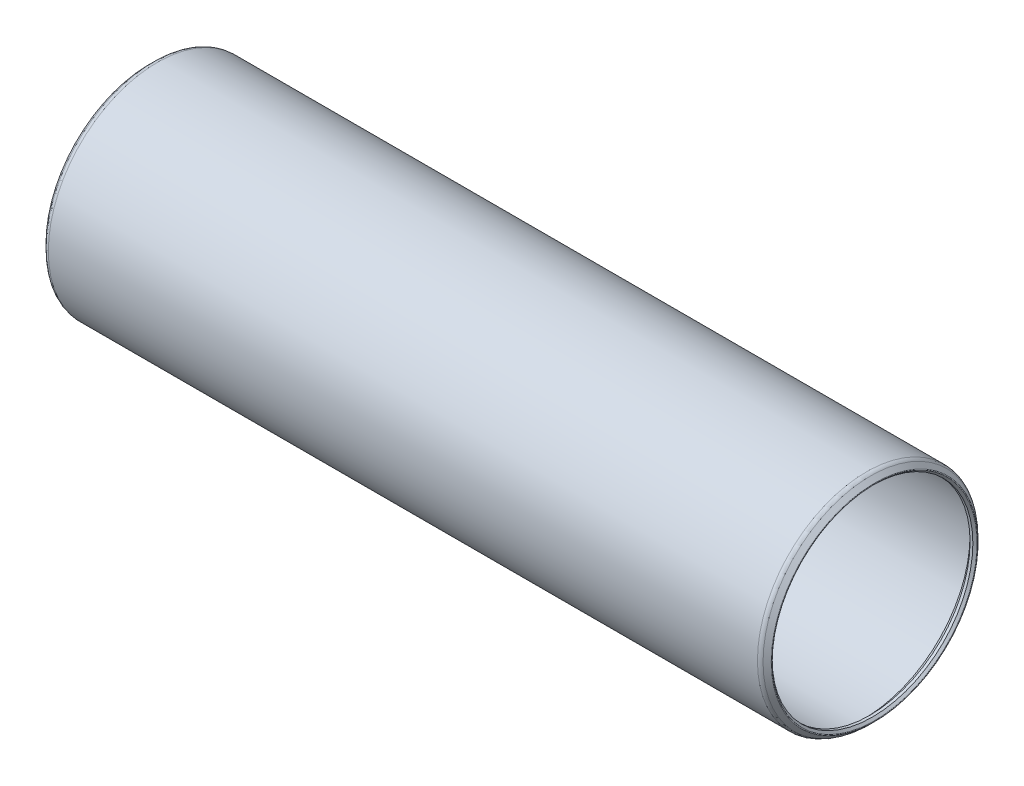
ISO-10303-21;
HEADER;
FILE_DESCRIPTION(('STEP AP214'),'2;1');
FILE_NAME('part.step','',(''),(''),'','','');
FILE_SCHEMA(('AUTOMOTIVE_DESIGN { 1 0 10303 214 1 1 1 1 }'));
ENDSEC;
DATA;
#1=APPLICATION_CONTEXT('core data for automotive mechanical design processes');
#2=APPLICATION_PROTOCOL_DEFINITION('international standard','automotive_design',2000,#1);
#3=PRODUCT_CONTEXT('',#1,'mechanical');
#4=PRODUCT('Part','Part','',(#3));
#5=PRODUCT_RELATED_PRODUCT_CATEGORY('part','',(#4));
#6=PRODUCT_DEFINITION_FORMATION('','',#4);
#7=PRODUCT_DEFINITION_CONTEXT('part definition',#1,'design');
#8=PRODUCT_DEFINITION('design','',#6,#7);
#9=PRODUCT_DEFINITION_SHAPE('','',#8);
#10=(LENGTH_UNIT() NAMED_UNIT(*) SI_UNIT(.MILLI.,.METRE.));
#11=(NAMED_UNIT(*) PLANE_ANGLE_UNIT() SI_UNIT($,.RADIAN.));
#12=(NAMED_UNIT(*) SI_UNIT($,.STERADIAN.) SOLID_ANGLE_UNIT());
#13=UNCERTAINTY_MEASURE_WITH_UNIT(LENGTH_MEASURE(1.E-05),#10,'distance_accuracy_value','');
#14=(GEOMETRIC_REPRESENTATION_CONTEXT(3) GLOBAL_UNCERTAINTY_ASSIGNED_CONTEXT((#13)) GLOBAL_UNIT_ASSIGNED_CONTEXT((#10,
#11,#12)) REPRESENTATION_CONTEXT('',''));
#15=CARTESIAN_POINT('',(0.,0.,0.));
#16=DIRECTION('',(0.,0.,1.));
#17=DIRECTION('',(1.,0.,0.));
#18=AXIS2_PLACEMENT_3D('',#15,#16,#17);
#19=CARTESIAN_POINT('',(-0.792815367264612,0.,0.));
#20=DIRECTION('',(-1.,0.,0.));
#21=DIRECTION('',(0.,0.,1.));
#22=AXIS2_PLACEMENT_3D('',#19,#20,#21);
#23=TOROIDAL_SURFACE('',#22,18.6444704896855,0.126999999999538);
#24=CARTESIAN_POINT('',(-0.882617928474827,0.,0.));
#25=DIRECTION('',(-1.,0.,0.));
#26=DIRECTION('',(0.,0.,1.));
#27=AXIS2_PLACEMENT_3D('',#24,#25,#26);
#28=CIRCLE('',#27,18.554667928475);
#29=CARTESIAN_POINT('',(-0.882617928474827,0.,18.554667928475));
#30=VERTEX_POINT('',#29);
#31=EDGE_CURVE('E10',#30,#30,#28,.T.);
#32=ORIENTED_EDGE('',*,*,#31,.F.);
#33=EDGE_LOOP('',(#32));
#34=FACE_BOUND('',#33,.T.);
#35=CARTESIAN_POINT('',(-0.882617928474827,0.,0.));
#36=DIRECTION('',(-1.,0.,0.));
#37=DIRECTION('',(0.,0.,1.));
#38=AXIS2_PLACEMENT_3D('',#35,#36,#37);
#39=CIRCLE('',#38,18.734273050896);
#40=CARTESIAN_POINT('',(-0.882617928474827,0.,18.734273050896));
#41=VERTEX_POINT('',#40);
#42=EDGE_CURVE('E82',#41,#41,#39,.T.);
#43=ORIENTED_EDGE('',*,*,#42,.T.);
#44=EDGE_LOOP('',(#43));
#45=FACE_BOUND('',#44,.T.);
#46=ADVANCED_FACE('F36',(#34,#45),#23,.T.);
#47=CARTESIAN_POINT('',(-0.882617928474827,0.,0.));
#48=DIRECTION('',(-1.,0.,0.));
#49=DIRECTION('',(0.,0.,1.));
#50=AXIS2_PLACEMENT_3D('',#47,#48,#49);
#51=CONICAL_SURFACE('',#50,18.554667928475,0.785398163397684);
#52=CARTESIAN_POINT('',(-0.508000000000008,0.,0.));
#53=DIRECTION('',(-1.,0.,0.));
#54=DIRECTION('',(0.,0.,1.));
#55=AXIS2_PLACEMENT_3D('',#52,#53,#54);
#56=CIRCLE('',#55,18.18005);
#57=CARTESIAN_POINT('',(-0.508000000000008,0.,18.18005));
#58=VERTEX_POINT('',#57);
#59=EDGE_CURVE('E42',#58,#58,#56,.T.);
#60=ORIENTED_EDGE('',*,*,#59,.F.);
#61=EDGE_LOOP('',(#60));
#62=FACE_BOUND('',#61,.T.);
#63=ORIENTED_EDGE('',*,*,#31,.T.);
#64=EDGE_LOOP('',(#63));
#65=FACE_BOUND('',#64,.T.);
#66=ADVANCED_FACE('F155',(#62,#65),#51,.F.);
#67=CARTESIAN_POINT('',(129.6035,0.,0.));
#68=DIRECTION('',(-1.,0.,0.));
#69=DIRECTION('',(0.,0.,1.));
#70=AXIS2_PLACEMENT_3D('',#67,#68,#69);
#71=CYLINDRICAL_SURFACE('',#70,18.18005);
#72=CARTESIAN_POINT('',(0.,0.,0.));
#73=DIRECTION('',(-1.,0.,0.));
#74=DIRECTION('',(0.,0.,1.));
#75=AXIS2_PLACEMENT_3D('',#72,#73,#74);
#76=CIRCLE('',#75,18.18005);
#77=CARTESIAN_POINT('',(0.,0.,18.18005));
#78=VERTEX_POINT('',#77);
#79=EDGE_CURVE('E46',#78,#78,#76,.T.);
#80=ORIENTED_EDGE('',*,*,#79,.F.);
#81=EDGE_LOOP('',(#80));
#82=FACE_BOUND('',#81,.T.);
#83=ORIENTED_EDGE('',*,*,#59,.T.);
#84=EDGE_LOOP('',(#83));
#85=FACE_BOUND('',#84,.T.);
#86=ADVANCED_FACE('F150',(#82,#85),#71,.F.);
#87=CARTESIAN_POINT('',(0.,0.,0.));
#88=DIRECTION('',(1.,0.,0.));
#89=DIRECTION('',(0.,0.,-1.));
#90=AXIS2_PLACEMENT_3D('',#87,#88,#89);
#91=CONICAL_SURFACE('',#90,18.18005,0.785398163397452);
#92=CARTESIAN_POINT('',(1.01599999999999,0.,0.));
#93=DIRECTION('',(-1.,0.,0.));
#94=DIRECTION('',(0.,0.,1.));
#95=AXIS2_PLACEMENT_3D('',#92,#93,#94);
#96=CIRCLE('',#95,19.19605);
#97=CARTESIAN_POINT('',(1.01599999999999,0.,19.19605));
#98=VERTEX_POINT('',#97);
#99=EDGE_CURVE('E50',#98,#98,#96,.T.);
#100=ORIENTED_EDGE('',*,*,#99,.F.);
#101=EDGE_LOOP('',(#100));
#102=FACE_BOUND('',#101,.T.);
#103=ORIENTED_EDGE('',*,*,#79,.T.);
#104=EDGE_LOOP('',(#103));
#105=FACE_BOUND('',#104,.T.);
#106=ADVANCED_FACE('F144',(#102,#105),#91,.F.);
#107=CARTESIAN_POINT('',(129.6035,0.,0.));
#108=DIRECTION('',(-1.,0.,0.));
#109=DIRECTION('',(0.,0.,1.));
#110=AXIS2_PLACEMENT_3D('',#107,#108,#109);
#111=CYLINDRICAL_SURFACE('',#110,19.19605);
#112=CARTESIAN_POINT('',(128.5875,0.,0.));
#113=DIRECTION('',(-1.,0.,0.));
#114=DIRECTION('',(0.,0.,1.));
#115=AXIS2_PLACEMENT_3D('',#112,#113,#114);
#116=CIRCLE('',#115,19.19605);
#117=CARTESIAN_POINT('',(128.5875,0.,19.19605));
#118=VERTEX_POINT('',#117);
#119=EDGE_CURVE('E55',#118,#118,#116,.T.);
#120=ORIENTED_EDGE('',*,*,#119,.F.);
#121=EDGE_LOOP('',(#120));
#122=FACE_BOUND('',#121,.T.);
#123=ORIENTED_EDGE('',*,*,#99,.T.);
#124=EDGE_LOOP('',(#123));
#125=FACE_BOUND('',#124,.T.);
#126=ADVANCED_FACE('F138',(#122,#125),#111,.F.);
#127=CARTESIAN_POINT('',(128.5875,0.,0.));
#128=DIRECTION('',(-1.,0.,0.));
#129=DIRECTION('',(0.,0.,1.));
#130=AXIS2_PLACEMENT_3D('',#127,#128,#129);
#131=CONICAL_SURFACE('',#130,19.19605,0.785398163397452);
#132=CARTESIAN_POINT('',(129.6035,0.,0.));
#133=DIRECTION('',(-1.,0.,0.));
#134=DIRECTION('',(0.,0.,1.));
#135=AXIS2_PLACEMENT_3D('',#132,#133,#134);
#136=CIRCLE('',#135,18.18005);
#137=CARTESIAN_POINT('',(129.6035,0.,18.18005));
#138=VERTEX_POINT('',#137);
#139=EDGE_CURVE('E58',#138,#138,#136,.T.);
#140=ORIENTED_EDGE('',*,*,#139,.F.);
#141=EDGE_LOOP('',(#140));
#142=FACE_BOUND('',#141,.T.);
#143=ORIENTED_EDGE('',*,*,#119,.T.);
#144=EDGE_LOOP('',(#143));
#145=FACE_BOUND('',#144,.T.);
#146=ADVANCED_FACE('F132',(#142,#145),#131,.F.);
#147=CARTESIAN_POINT('',(129.6035,0.,0.));
#148=DIRECTION('',(-1.,0.,0.));
#149=DIRECTION('',(0.,0.,1.));
#150=AXIS2_PLACEMENT_3D('',#147,#148,#149);
#151=CYLINDRICAL_SURFACE('',#150,18.18005);
#152=CARTESIAN_POINT('',(130.1115,0.,0.));
#153=DIRECTION('',(-1.,0.,0.));
#154=DIRECTION('',(0.,0.,1.));
#155=AXIS2_PLACEMENT_3D('',#152,#153,#154);
#156=CIRCLE('',#155,18.18005);
#157=CARTESIAN_POINT('',(130.1115,0.,18.18005));
#158=VERTEX_POINT('',#157);
#159=EDGE_CURVE('E61',#158,#158,#156,.T.);
#160=ORIENTED_EDGE('',*,*,#159,.F.);
#161=EDGE_LOOP('',(#160));
#162=FACE_BOUND('',#161,.T.);
#163=ORIENTED_EDGE('',*,*,#139,.T.);
#164=EDGE_LOOP('',(#163));
#165=FACE_BOUND('',#164,.T.);
#166=ADVANCED_FACE('F126',(#162,#165),#151,.F.);
#167=CARTESIAN_POINT('',(130.1115,0.,0.));
#168=DIRECTION('',(1.,0.,0.));
#169=DIRECTION('',(0.,0.,-1.));
#170=AXIS2_PLACEMENT_3D('',#167,#168,#169);
#171=CONICAL_SURFACE('',#170,18.18005,0.785398163397467);
#172=CARTESIAN_POINT('',(130.486117928479,0.,0.));
#173=DIRECTION('',(-1.,0.,0.));
#174=DIRECTION('',(0.,0.,1.));
#175=AXIS2_PLACEMENT_3D('',#172,#173,#174);
#176=CIRCLE('',#175,18.5546679284786);
#177=CARTESIAN_POINT('',(130.486117928479,0.,18.5546679284786));
#178=VERTEX_POINT('',#177);
#179=EDGE_CURVE('E64',#178,#178,#176,.T.);
#180=ORIENTED_EDGE('',*,*,#179,.F.);
#181=EDGE_LOOP('',(#180));
#182=FACE_BOUND('',#181,.T.);
#183=ORIENTED_EDGE('',*,*,#159,.T.);
#184=EDGE_LOOP('',(#183));
#185=FACE_BOUND('',#184,.T.);
#186=ADVANCED_FACE('F120',(#182,#185),#171,.F.);
#187=CARTESIAN_POINT('',(130.396315367269,0.,0.));
#188=DIRECTION('',(-1.,0.,0.));
#189=DIRECTION('',(0.,0.,1.));
#190=AXIS2_PLACEMENT_3D('',#187,#188,#189);
#191=TOROIDAL_SURFACE('',#190,18.6444704896878,0.126999999997884);
#192=CARTESIAN_POINT('',(130.486117928479,0.,0.));
#193=DIRECTION('',(-1.,0.,0.));
#194=DIRECTION('',(0.,0.,1.));
#195=AXIS2_PLACEMENT_3D('',#192,#193,#194);
#196=CIRCLE('',#195,18.734273050897);
#197=CARTESIAN_POINT('',(130.486117928479,0.,18.734273050897));
#198=VERTEX_POINT('',#197);
#199=EDGE_CURVE('E67',#198,#198,#196,.T.);
#200=ORIENTED_EDGE('',*,*,#199,.F.);
#201=EDGE_LOOP('',(#200));
#202=FACE_BOUND('',#201,.T.);
#203=ORIENTED_EDGE('',*,*,#179,.T.);
#204=EDGE_LOOP('',(#203));
#205=FACE_BOUND('',#204,.T.);
#206=ADVANCED_FACE('F114',(#202,#205),#191,.T.);
#207=CARTESIAN_POINT('',(130.486117928479,0.,0.));
#208=DIRECTION('',(-1.,0.,0.));
#209=DIRECTION('',(0.,0.,1.));
#210=AXIS2_PLACEMENT_3D('',#207,#208,#209);
#211=CONICAL_SURFACE('',#210,18.734273050897,0.785398163397418);
#212=CARTESIAN_POINT('',(129.750420489703,0.,0.));
#213=DIRECTION('',(-1.,0.,0.));
#214=DIRECTION('',(0.,0.,1.));
#215=AXIS2_PLACEMENT_3D('',#212,#213,#214);
#216=CIRCLE('',#215,19.4699704896729);
#217=CARTESIAN_POINT('',(129.750420489703,0.,19.4699704896729));
#218=VERTEX_POINT('',#217);
#219=EDGE_CURVE('E70',#218,#218,#216,.T.);
#220=ORIENTED_EDGE('',*,*,#219,.F.);
#221=EDGE_LOOP('',(#220));
#222=FACE_BOUND('',#221,.T.);
#223=ORIENTED_EDGE('',*,*,#199,.T.);
#224=EDGE_LOOP('',(#223));
#225=FACE_BOUND('',#224,.T.);
#226=ADVANCED_FACE('F108',(#222,#225),#211,.T.);
#227=CARTESIAN_POINT('',(129.031999999988,0.,0.));
#228=DIRECTION('',(-1.,0.,0.));
#229=DIRECTION('',(0.,0.,1.));
#230=AXIS2_PLACEMENT_3D('',#227,#228,#229);
#231=TOROIDAL_SURFACE('',#230,18.7515499999582,1.01600000004156);
#232=CARTESIAN_POINT('',(129.031999999988,0.,0.));
#233=DIRECTION('',(-1.,0.,0.));
#234=DIRECTION('',(0.,0.,1.));
#235=AXIS2_PLACEMENT_3D('',#232,#233,#234);
#236=CIRCLE('',#235,19.7675499999997);
#237=CARTESIAN_POINT('',(129.031999999988,0.,19.7675499999997));
#238=VERTEX_POINT('',#237);
#239=EDGE_CURVE('E73',#238,#238,#236,.T.);
#240=ORIENTED_EDGE('',*,*,#239,.F.);
#241=EDGE_LOOP('',(#240));
#242=FACE_BOUND('',#241,.T.);
#243=ORIENTED_EDGE('',*,*,#219,.T.);
#244=EDGE_LOOP('',(#243));
#245=FACE_BOUND('',#244,.T.);
#246=ADVANCED_FACE('F102',(#242,#245),#231,.T.);
#247=CARTESIAN_POINT('',(129.6035,0.,0.));
#248=DIRECTION('',(-1.,0.,0.));
#249=DIRECTION('',(0.,0.,1.));
#250=AXIS2_PLACEMENT_3D('',#247,#248,#249);
#251=CYLINDRICAL_SURFACE('',#250,19.7675499999996);
#252=CARTESIAN_POINT('',(0.571500000002972,0.,0.));
#253=DIRECTION('',(-1.,0.,0.));
#254=DIRECTION('',(0.,0.,1.));
#255=AXIS2_PLACEMENT_3D('',#252,#253,#254);
#256=CIRCLE('',#255,19.7675499999996);
#257=CARTESIAN_POINT('',(0.571500000002972,0.,19.7675499999996));
#258=VERTEX_POINT('',#257);
#259=EDGE_CURVE('E76',#258,#258,#256,.T.);
#260=ORIENTED_EDGE('',*,*,#259,.F.);
#261=EDGE_LOOP('',(#260));
#262=FACE_BOUND('',#261,.T.);
#263=ORIENTED_EDGE('',*,*,#239,.T.);
#264=EDGE_LOOP('',(#263));
#265=FACE_BOUND('',#264,.T.);
#266=ADVANCED_FACE('F96',(#262,#265),#251,.T.);
#267=CARTESIAN_POINT('',(0.571500000002629,0.,0.));
#268=DIRECTION('',(-1.,0.,0.));
#269=DIRECTION('',(0.,0.,1.));
#270=AXIS2_PLACEMENT_3D('',#267,#268,#269);
#271=TOROIDAL_SURFACE('',#270,18.7515499999925,1.01600000000705);
#272=CARTESIAN_POINT('',(-0.146920489687841,0.,0.));
#273=DIRECTION('',(-1.,0.,0.));
#274=DIRECTION('',(0.,0.,1.));
#275=AXIS2_PLACEMENT_3D('',#272,#273,#274);
#276=CIRCLE('',#275,19.469970489683);
#277=CARTESIAN_POINT('',(-0.146920489687841,0.,19.469970489683));
#278=VERTEX_POINT('',#277);
#279=EDGE_CURVE('E79',#278,#278,#276,.T.);
#280=ORIENTED_EDGE('',*,*,#279,.F.);
#281=EDGE_LOOP('',(#280));
#282=FACE_BOUND('',#281,.T.);
#283=ORIENTED_EDGE('',*,*,#259,.T.);
#284=EDGE_LOOP('',(#283));
#285=FACE_BOUND('',#284,.T.);
#286=ADVANCED_FACE('F90',(#282,#285),#271,.T.);
#287=CARTESIAN_POINT('',(-0.146920489687841,0.,0.));
#288=DIRECTION('',(1.,0.,0.));
#289=DIRECTION('',(0.,0.,-1.));
#290=AXIS2_PLACEMENT_3D('',#287,#288,#289);
#291=CONICAL_SURFACE('',#290,19.469970489683,0.78539816339746);
#292=ORIENTED_EDGE('',*,*,#42,.F.);
#293=EDGE_LOOP('',(#292));
#294=FACE_BOUND('',#293,.T.);
#295=ORIENTED_EDGE('',*,*,#279,.T.);
#296=EDGE_LOOP('',(#295));
#297=FACE_BOUND('',#296,.T.);
#298=ADVANCED_FACE('F87',(#294,#297),#291,.T.);
#299=CLOSED_SHELL('',(#46,#66,#86,#106,#126,#146,#166,#186,#206,#226,#246,#266,#286,#298));
#300=MANIFOLD_SOLID_BREP('B2',#299);
#301=ADVANCED_BREP_SHAPE_REPRESENTATION('',(#18,#300),#14);
#302=SHAPE_DEFINITION_REPRESENTATION(#9,#301);
ENDSEC;
END-ISO-10303-21;
